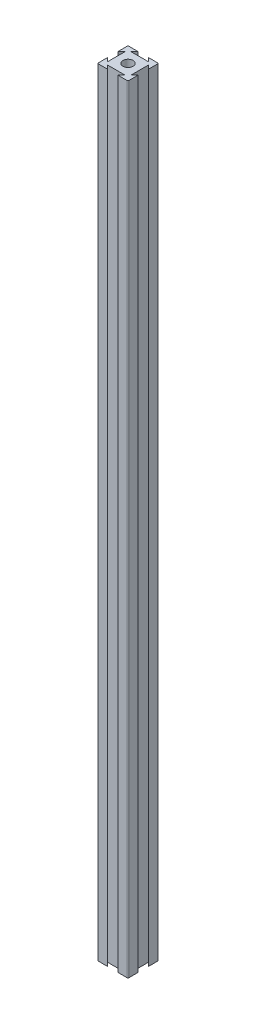
ISO-10303-21;
HEADER;
FILE_DESCRIPTION(('STEP AP214'),'2;1');
FILE_NAME('part.step','',(''),(''),'','','');
FILE_SCHEMA(('AUTOMOTIVE_DESIGN { 1 0 10303 214 1 1 1 1 }'));
ENDSEC;
DATA;
#1=APPLICATION_CONTEXT('core data for automotive mechanical design processes');
#2=APPLICATION_PROTOCOL_DEFINITION('international standard','automotive_design',2000,#1);
#3=PRODUCT_CONTEXT('',#1,'mechanical');
#4=PRODUCT('Part','Part','',(#3));
#5=PRODUCT_RELATED_PRODUCT_CATEGORY('part','',(#4));
#6=PRODUCT_DEFINITION_FORMATION('','',#4);
#7=PRODUCT_DEFINITION_CONTEXT('part definition',#1,'design');
#8=PRODUCT_DEFINITION('design','',#6,#7);
#9=PRODUCT_DEFINITION_SHAPE('','',#8);
#10=(LENGTH_UNIT() NAMED_UNIT(*) SI_UNIT(.MILLI.,.METRE.));
#11=(NAMED_UNIT(*) PLANE_ANGLE_UNIT() SI_UNIT($,.RADIAN.));
#12=(NAMED_UNIT(*) SI_UNIT($,.STERADIAN.) SOLID_ANGLE_UNIT());
#13=UNCERTAINTY_MEASURE_WITH_UNIT(LENGTH_MEASURE(1.E-05),#10,'distance_accuracy_value','');
#14=(GEOMETRIC_REPRESENTATION_CONTEXT(3) GLOBAL_UNCERTAINTY_ASSIGNED_CONTEXT((#13)) GLOBAL_UNIT_ASSIGNED_CONTEXT((#10,
#11,#12)) REPRESENTATION_CONTEXT('',''));
#15=CARTESIAN_POINT('',(0.,0.,0.));
#16=DIRECTION('',(0.,0.,1.));
#17=DIRECTION('',(1.,0.,0.));
#18=AXIS2_PLACEMENT_3D('',#15,#16,#17);
#19=CARTESIAN_POINT('',(16.6666666666667,508.762,-16.6666666666667));
#20=DIRECTION('',(-0.707106781186547,0.,0.707106781186548));
#21=DIRECTION('',(0.707106781186548,0.,0.707106781186547));
#22=AXIS2_PLACEMENT_3D('',#19,#20,#21);
#23=PLANE('',#22);
#24=DIRECTION('',(-0.707106781186548,0.,-0.707106781186547));
#25=VECTOR('',#24,1.);
#26=CARTESIAN_POINT('',(16.6666666666667,0.,-16.6666666666667));
#27=LINE('',#26,#25);
#28=CARTESIAN_POINT('',(20.,0.,-13.3333333333333));
#29=VERTEX_POINT('',#28);
#30=CARTESIAN_POINT('',(17.6183333333333,0.,-15.715));
#31=VERTEX_POINT('',#30);
#32=EDGE_CURVE('E203',#29,#31,#27,.T.);
#33=ORIENTED_EDGE('',*,*,#32,.F.);
#34=DIRECTION('',(0.,-1.,0.));
#35=VECTOR('',#34,1.);
#36=CARTESIAN_POINT('',(20.,508.762,-13.3333333333333));
#37=LINE('',#36,#35);
#38=CARTESIAN_POINT('',(20.,508.762,-13.3333333333333));
#39=VERTEX_POINT('',#38);
#40=EDGE_CURVE('E197',#39,#29,#37,.T.);
#41=ORIENTED_EDGE('',*,*,#40,.F.);
#42=DIRECTION('',(-0.707106781186548,0.,-0.707106781186547));
#43=VECTOR('',#42,1.);
#44=CARTESIAN_POINT('',(16.6666666666667,508.762,-16.6666666666667));
#45=LINE('',#44,#43);
#46=CARTESIAN_POINT('',(17.6183333333333,508.762,-15.715));
#47=VERTEX_POINT('',#46);
#48=EDGE_CURVE('E200',#39,#47,#45,.T.);
#49=ORIENTED_EDGE('',*,*,#48,.T.);
#50=DIRECTION('',(0.,-1.,0.));
#51=VECTOR('',#50,1.);
#52=CARTESIAN_POINT('',(17.6183333333333,508.762,-15.715));
#53=LINE('',#52,#51);
#54=EDGE_CURVE('E271',#47,#31,#53,.T.);
#55=ORIENTED_EDGE('',*,*,#54,.T.);
#56=EDGE_LOOP('',(#33,#41,#49,#55));
#57=FACE_BOUND('',#56,.T.);
#58=ADVANCED_FACE('F37',(#57),#23,.T.);
#59=CARTESIAN_POINT('',(20.,508.762,0.));
#60=DIRECTION('',(-1.,0.,0.));
#61=DIRECTION('',(0.,0.,1.));
#62=AXIS2_PLACEMENT_3D('',#59,#60,#61);
#63=PLANE('',#62);
#64=DIRECTION('',(0.,0.,-1.));
#65=VECTOR('',#64,1.);
#66=CARTESIAN_POINT('',(20.,0.,0.));
#67=LINE('',#66,#65);
#68=CARTESIAN_POINT('',(20.,0.,-19.492));
#69=VERTEX_POINT('',#68);
#70=EDGE_CURVE('E276',#29,#69,#67,.T.);
#71=ORIENTED_EDGE('',*,*,#70,.T.);
#72=DIRECTION('',(0.,-1.,0.));
#73=VECTOR('',#72,1.);
#74=CARTESIAN_POINT('',(20.,508.762,-19.492));
#75=LINE('',#74,#73);
#76=CARTESIAN_POINT('',(20.,508.762,-19.492));
#77=VERTEX_POINT('',#76);
#78=EDGE_CURVE('E214',#69,#77,#75,.F.);
#79=ORIENTED_EDGE('',*,*,#78,.T.);
#80=DIRECTION('',(0.,0.,-1.));
#81=VECTOR('',#80,1.);
#82=CARTESIAN_POINT('',(20.,508.762,0.));
#83=LINE('',#82,#81);
#84=EDGE_CURVE('E211',#39,#77,#83,.T.);
#85=ORIENTED_EDGE('',*,*,#84,.F.);
#86=ORIENTED_EDGE('',*,*,#40,.T.);
#87=EDGE_LOOP('',(#71,#79,#85,#86));
#88=FACE_BOUND('',#87,.T.);
#89=ADVANCED_FACE('F212',(#88),#63,.F.);
#90=CARTESIAN_POINT('',(0.,508.762,-20.));
#91=DIRECTION('',(0.,0.,-1.));
#92=DIRECTION('',(-1.,0.,0.));
#93=AXIS2_PLACEMENT_3D('',#90,#91,#92);
#94=PLANE('',#93);
#95=DIRECTION('',(1.,0.,0.));
#96=VECTOR('',#95,1.);
#97=CARTESIAN_POINT('',(0.,508.762,-20.));
#98=LINE('',#97,#96);
#99=CARTESIAN_POINT('',(13.3333333333333,508.762,-20.));
#100=VERTEX_POINT('',#99);
#101=CARTESIAN_POINT('',(19.492,508.762,-20.));
#102=VERTEX_POINT('',#101);
#103=EDGE_CURVE('E216',#100,#102,#98,.T.);
#104=ORIENTED_EDGE('',*,*,#103,.T.);
#105=DIRECTION('',(0.,-1.,0.));
#106=VECTOR('',#105,1.);
#107=CARTESIAN_POINT('',(19.492,0.,-20.));
#108=LINE('',#107,#106);
#109=CARTESIAN_POINT('',(19.492,0.,-20.));
#110=VERTEX_POINT('',#109);
#111=EDGE_CURVE('E378',#102,#110,#108,.T.);
#112=ORIENTED_EDGE('',*,*,#111,.T.);
#113=DIRECTION('',(1.,0.,0.));
#114=VECTOR('',#113,1.);
#115=CARTESIAN_POINT('',(0.,0.,-20.));
#116=LINE('',#115,#114);
#117=CARTESIAN_POINT('',(13.3333333333333,0.,-20.));
#118=VERTEX_POINT('',#117);
#119=EDGE_CURVE('E278',#118,#110,#116,.T.);
#120=ORIENTED_EDGE('',*,*,#119,.F.);
#121=DIRECTION('',(0.,-1.,0.));
#122=VECTOR('',#121,1.);
#123=CARTESIAN_POINT('',(13.3333333333333,508.762,-20.));
#124=LINE('',#123,#122);
#125=EDGE_CURVE('E208',#100,#118,#124,.T.);
#126=ORIENTED_EDGE('',*,*,#125,.F.);
#127=EDGE_LOOP('',(#104,#112,#120,#126));
#128=FACE_BOUND('',#127,.T.);
#129=ADVANCED_FACE('F410',(#128),#94,.T.);
#130=CARTESIAN_POINT('',(16.6666666666666,508.762,-16.6666666666668));
#131=DIRECTION('',(-0.707106781186544,0.,0.707106781186551));
#132=DIRECTION('',(0.707106781186551,0.,0.707106781186544));
#133=AXIS2_PLACEMENT_3D('',#130,#131,#132);
#134=PLANE('',#133);
#135=DIRECTION('',(-0.707106781186551,0.,-0.707106781186544));
#136=VECTOR('',#135,1.);
#137=CARTESIAN_POINT('',(16.6666666666666,0.,-16.6666666666668));
#138=LINE('',#137,#136);
#139=CARTESIAN_POINT('',(15.715,0.,-17.6183333333334));
#140=VERTEX_POINT('',#139);
#141=EDGE_CURVE('E282',#140,#118,#138,.T.);
#142=ORIENTED_EDGE('',*,*,#141,.F.);
#143=DIRECTION('',(0.,-1.,0.));
#144=VECTOR('',#143,1.);
#145=CARTESIAN_POINT('',(15.715,508.762,-17.6183333333334));
#146=LINE('',#145,#144);
#147=CARTESIAN_POINT('',(15.715,508.762,-17.6183333333334));
#148=VERTEX_POINT('',#147);
#149=EDGE_CURVE('E356',#148,#140,#146,.T.);
#150=ORIENTED_EDGE('',*,*,#149,.F.);
#151=DIRECTION('',(-0.707106781186551,0.,-0.707106781186544));
#152=VECTOR('',#151,1.);
#153=CARTESIAN_POINT('',(16.6666666666666,508.762,-16.6666666666668));
#154=LINE('',#153,#152);
#155=EDGE_CURVE('E232',#148,#100,#154,.T.);
#156=ORIENTED_EDGE('',*,*,#155,.T.);
#157=ORIENTED_EDGE('',*,*,#125,.T.);
#158=EDGE_LOOP('',(#142,#150,#156,#157));
#159=FACE_BOUND('',#158,.T.);
#160=ADVANCED_FACE('F414',(#159),#134,.T.);
#161=CARTESIAN_POINT('',(0.,508.762,-17.6183333333334));
#162=DIRECTION('',(0.,0.,-1.));
#163=DIRECTION('',(-1.,0.,0.));
#164=AXIS2_PLACEMENT_3D('',#161,#162,#163);
#165=PLANE('',#164);
#166=DIRECTION('',(1.,0.,0.));
#167=VECTOR('',#166,1.);
#168=CARTESIAN_POINT('',(0.,0.,-17.6183333333334));
#169=LINE('',#168,#167);
#170=CARTESIAN_POINT('',(4.285,0.,-17.6183333333334));
#171=VERTEX_POINT('',#170);
#172=EDGE_CURVE('E286',#171,#140,#169,.T.);
#173=ORIENTED_EDGE('',*,*,#172,.F.);
#174=DIRECTION('',(0.,-1.,0.));
#175=VECTOR('',#174,1.);
#176=CARTESIAN_POINT('',(4.285,508.762,-17.6183333333334));
#177=LINE('',#176,#175);
#178=CARTESIAN_POINT('',(4.285,508.762,-17.6183333333334));
#179=VERTEX_POINT('',#178);
#180=EDGE_CURVE('E354',#179,#171,#177,.T.);
#181=ORIENTED_EDGE('',*,*,#180,.F.);
#182=DIRECTION('',(1.,0.,0.));
#183=VECTOR('',#182,1.);
#184=CARTESIAN_POINT('',(0.,508.762,-17.6183333333334));
#185=LINE('',#184,#183);
#186=EDGE_CURVE('E236',#179,#148,#185,.T.);
#187=ORIENTED_EDGE('',*,*,#186,.T.);
#188=ORIENTED_EDGE('',*,*,#149,.T.);
#189=EDGE_LOOP('',(#173,#181,#187,#188));
#190=FACE_BOUND('',#189,.T.);
#191=ADVANCED_FACE('F441',(#190),#165,.T.);
#192=CARTESIAN_POINT('',(-6.6666666666667,508.762,-6.66666666666677));
#193=DIRECTION('',(0.707106781186544,0.,0.707106781186551));
#194=DIRECTION('',(0.707106781186551,0.,-0.707106781186544));
#195=AXIS2_PLACEMENT_3D('',#192,#193,#194);
#196=PLANE('',#195);
#197=DIRECTION('',(-0.707106781186551,0.,0.707106781186544));
#198=VECTOR('',#197,1.);
#199=CARTESIAN_POINT('',(-6.6666666666667,0.,-6.66666666666677));
#200=LINE('',#199,#198);
#201=CARTESIAN_POINT('',(6.66666666666666,0.,-20.));
#202=VERTEX_POINT('',#201);
#203=EDGE_CURVE('E289',#202,#171,#200,.T.);
#204=ORIENTED_EDGE('',*,*,#203,.F.);
#205=DIRECTION('',(0.,-1.,0.));
#206=VECTOR('',#205,1.);
#207=CARTESIAN_POINT('',(6.66666666666666,508.762,-20.));
#208=LINE('',#207,#206);
#209=CARTESIAN_POINT('',(6.66666666666666,508.762,-20.));
#210=VERTEX_POINT('',#209);
#211=EDGE_CURVE('E351',#210,#202,#208,.T.);
#212=ORIENTED_EDGE('',*,*,#211,.F.);
#213=DIRECTION('',(-0.707106781186551,0.,0.707106781186544));
#214=VECTOR('',#213,1.);
#215=CARTESIAN_POINT('',(-6.6666666666667,508.762,-6.66666666666677));
#216=LINE('',#215,#214);
#217=EDGE_CURVE('E239',#210,#179,#216,.T.);
#218=ORIENTED_EDGE('',*,*,#217,.T.);
#219=ORIENTED_EDGE('',*,*,#180,.T.);
#220=EDGE_LOOP('',(#204,#212,#218,#219));
#221=FACE_BOUND('',#220,.T.);
#222=ADVANCED_FACE('F444',(#221),#196,.T.);
#223=CARTESIAN_POINT('',(0.508,0.,-20.));
#224=VERTEX_POINT('',#223);
#225=EDGE_CURVE('E283',#224,#202,#116,.T.);
#226=ORIENTED_EDGE('',*,*,#225,.F.);
#227=DIRECTION('',(0.,-1.,0.));
#228=VECTOR('',#227,1.);
#229=CARTESIAN_POINT('',(0.508,508.762,-20.));
#230=LINE('',#229,#228);
#231=CARTESIAN_POINT('',(0.508,508.762,-20.));
#232=VERTEX_POINT('',#231);
#233=EDGE_CURVE('E369',#224,#232,#230,.F.);
#234=ORIENTED_EDGE('',*,*,#233,.T.);
#235=EDGE_CURVE('E233',#232,#210,#98,.T.);
#236=ORIENTED_EDGE('',*,*,#235,.T.);
#237=ORIENTED_EDGE('',*,*,#211,.T.);
#238=EDGE_LOOP('',(#226,#234,#236,#237));
#239=FACE_BOUND('',#238,.T.);
#240=ADVANCED_FACE('F507',(#239),#94,.T.);
#241=CARTESIAN_POINT('',(0.,508.762,0.));
#242=DIRECTION('',(-1.,0.,0.));
#243=DIRECTION('',(0.,0.,1.));
#244=AXIS2_PLACEMENT_3D('',#241,#242,#243);
#245=PLANE('',#244);
#246=DIRECTION('',(0.,0.,-1.));
#247=VECTOR('',#246,1.);
#248=CARTESIAN_POINT('',(0.,508.762,0.));
#249=LINE('',#248,#247);
#250=CARTESIAN_POINT('',(0.,508.762,-13.3333333333333));
#251=VERTEX_POINT('',#250);
#252=CARTESIAN_POINT('',(0.,508.762,-19.492));
#253=VERTEX_POINT('',#252);
#254=EDGE_CURVE('E242',#251,#253,#249,.T.);
#255=ORIENTED_EDGE('',*,*,#254,.T.);
#256=DIRECTION('',(0.,-1.,0.));
#257=VECTOR('',#256,1.);
#258=CARTESIAN_POINT('',(0.,508.762,-19.492));
#259=LINE('',#258,#257);
#260=CARTESIAN_POINT('',(0.,0.,-19.492));
#261=VERTEX_POINT('',#260);
#262=EDGE_CURVE('E207',#253,#261,#259,.T.);
#263=ORIENTED_EDGE('',*,*,#262,.T.);
#264=DIRECTION('',(0.,0.,-1.));
#265=VECTOR('',#264,1.);
#266=CARTESIAN_POINT('',(0.,0.,0.));
#267=LINE('',#266,#265);
#268=CARTESIAN_POINT('',(0.,0.,-13.3333333333333));
#269=VERTEX_POINT('',#268);
#270=EDGE_CURVE('E292',#269,#261,#267,.T.);
#271=ORIENTED_EDGE('',*,*,#270,.F.);
#272=DIRECTION('',(0.,-1.,0.));
#273=VECTOR('',#272,1.);
#274=CARTESIAN_POINT('',(0.,508.762,-13.3333333333333));
#275=LINE('',#274,#273);
#276=EDGE_CURVE('E349',#251,#269,#275,.T.);
#277=ORIENTED_EDGE('',*,*,#276,.F.);
#278=EDGE_LOOP('',(#255,#263,#271,#277));
#279=FACE_BOUND('',#278,.T.);
#280=ADVANCED_FACE('F453',(#279),#245,.T.);
#281=CARTESIAN_POINT('',(-6.66666666666667,508.762,-6.66666666666669));
#282=DIRECTION('',(-0.707106781186547,0.,-0.707106781186549));
#283=DIRECTION('',(-0.707106781186549,0.,0.707106781186547));
#284=AXIS2_PLACEMENT_3D('',#281,#282,#283);
#285=PLANE('',#284);
#286=DIRECTION('',(0.707106781186549,0.,-0.707106781186547));
#287=VECTOR('',#286,1.);
#288=CARTESIAN_POINT('',(-6.66666666666667,0.,-6.66666666666669));
#289=LINE('',#288,#287);
#290=CARTESIAN_POINT('',(2.38166666666667,0.,-15.715));
#291=VERTEX_POINT('',#290);
#292=EDGE_CURVE('E295',#269,#291,#289,.T.);
#293=ORIENTED_EDGE('',*,*,#292,.T.);
#294=DIRECTION('',(0.,-1.,0.));
#295=VECTOR('',#294,1.);
#296=CARTESIAN_POINT('',(2.38166666666667,508.762,-15.715));
#297=LINE('',#296,#295);
#298=CARTESIAN_POINT('',(2.38166666666667,508.762,-15.715));
#299=VERTEX_POINT('',#298);
#300=EDGE_CURVE('E346',#299,#291,#297,.T.);
#301=ORIENTED_EDGE('',*,*,#300,.F.);
#302=DIRECTION('',(0.707106781186549,0.,-0.707106781186547));
#303=VECTOR('',#302,1.);
#304=CARTESIAN_POINT('',(-6.66666666666667,508.762,-6.66666666666669));
#305=LINE('',#304,#303);
#306=EDGE_CURVE('E245',#251,#299,#305,.T.);
#307=ORIENTED_EDGE('',*,*,#306,.F.);
#308=ORIENTED_EDGE('',*,*,#276,.T.);
#309=EDGE_LOOP('',(#293,#301,#307,#308));
#310=FACE_BOUND('',#309,.T.);
#311=ADVANCED_FACE('F458',(#310),#285,.F.);
#312=CARTESIAN_POINT('',(2.38166666666667,508.762,0.));
#313=DIRECTION('',(1.,0.,0.));
#314=DIRECTION('',(0.,0.,-1.));
#315=AXIS2_PLACEMENT_3D('',#312,#313,#314);
#316=PLANE('',#315);
#317=DIRECTION('',(0.,0.,1.));
#318=VECTOR('',#317,1.);
#319=CARTESIAN_POINT('',(2.38166666666667,0.,0.));
#320=LINE('',#319,#318);
#321=CARTESIAN_POINT('',(2.38166666666667,0.,-4.285));
#322=VERTEX_POINT('',#321);
#323=EDGE_CURVE('E299',#291,#322,#320,.T.);
#324=ORIENTED_EDGE('',*,*,#323,.T.);
#325=DIRECTION('',(0.,-1.,0.));
#326=VECTOR('',#325,1.);
#327=CARTESIAN_POINT('',(2.38166666666667,508.762,-4.285));
#328=LINE('',#327,#326);
#329=CARTESIAN_POINT('',(2.38166666666667,508.762,-4.285));
#330=VERTEX_POINT('',#329);
#331=EDGE_CURVE('E343',#330,#322,#328,.T.);
#332=ORIENTED_EDGE('',*,*,#331,.F.);
#333=DIRECTION('',(0.,0.,1.));
#334=VECTOR('',#333,1.);
#335=CARTESIAN_POINT('',(2.38166666666667,508.762,0.));
#336=LINE('',#335,#334);
#337=EDGE_CURVE('E249',#299,#330,#336,.T.);
#338=ORIENTED_EDGE('',*,*,#337,.F.);
#339=ORIENTED_EDGE('',*,*,#300,.T.);
#340=EDGE_LOOP('',(#324,#332,#338,#339));
#341=FACE_BOUND('',#340,.T.);
#342=ADVANCED_FACE('F464',(#341),#316,.F.);
#343=CARTESIAN_POINT('',(3.33333333333333,508.762,-3.33333333333335));
#344=DIRECTION('',(-0.707106781186546,0.,0.707106781186549));
#345=DIRECTION('',(0.707106781186549,0.,0.707106781186546));
#346=AXIS2_PLACEMENT_3D('',#343,#344,#345);
#347=PLANE('',#346);
#348=DIRECTION('',(-0.707106781186549,0.,-0.707106781186546));
#349=VECTOR('',#348,1.);
#350=CARTESIAN_POINT('',(3.33333333333333,0.,-3.33333333333335));
#351=LINE('',#350,#349);
#352=CARTESIAN_POINT('',(0.,0.,-6.66666666666667));
#353=VERTEX_POINT('',#352);
#354=EDGE_CURVE('E302',#322,#353,#351,.T.);
#355=ORIENTED_EDGE('',*,*,#354,.T.);
#356=DIRECTION('',(0.,-1.,0.));
#357=VECTOR('',#356,1.);
#358=CARTESIAN_POINT('',(0.,508.762,-6.66666666666667));
#359=LINE('',#358,#357);
#360=CARTESIAN_POINT('',(0.,508.762,-6.66666666666667));
#361=VERTEX_POINT('',#360);
#362=EDGE_CURVE('E340',#361,#353,#359,.T.);
#363=ORIENTED_EDGE('',*,*,#362,.F.);
#364=DIRECTION('',(-0.707106781186549,0.,-0.707106781186546));
#365=VECTOR('',#364,1.);
#366=CARTESIAN_POINT('',(3.33333333333333,508.762,-3.33333333333335));
#367=LINE('',#366,#365);
#368=EDGE_CURVE('E252',#330,#361,#367,.T.);
#369=ORIENTED_EDGE('',*,*,#368,.F.);
#370=ORIENTED_EDGE('',*,*,#331,.T.);
#371=EDGE_LOOP('',(#355,#363,#369,#370));
#372=FACE_BOUND('',#371,.T.);
#373=ADVANCED_FACE('F466',(#372),#347,.F.);
#374=CARTESIAN_POINT('',(0.,0.,-0.508));
#375=VERTEX_POINT('',#374);
#376=EDGE_CURVE('E296',#375,#353,#267,.T.);
#377=ORIENTED_EDGE('',*,*,#376,.F.);
#378=DIRECTION('',(0.,-1.,0.));
#379=VECTOR('',#378,1.);
#380=CARTESIAN_POINT('',(0.,508.762,-0.508));
#381=LINE('',#380,#379);
#382=CARTESIAN_POINT('',(0.,508.762,-0.508));
#383=VERTEX_POINT('',#382);
#384=EDGE_CURVE('E385',#375,#383,#381,.F.);
#385=ORIENTED_EDGE('',*,*,#384,.T.);
#386=EDGE_CURVE('E246',#383,#361,#249,.T.);
#387=ORIENTED_EDGE('',*,*,#386,.T.);
#388=ORIENTED_EDGE('',*,*,#362,.T.);
#389=EDGE_LOOP('',(#377,#385,#387,#388));
#390=FACE_BOUND('',#389,.T.);
#391=ADVANCED_FACE('F469',(#390),#245,.T.);
#392=CARTESIAN_POINT('',(0.,508.762,0.));
#393=DIRECTION('',(0.,0.,-1.));
#394=DIRECTION('',(-1.,0.,0.));
#395=AXIS2_PLACEMENT_3D('',#392,#393,#394);
#396=PLANE('',#395);
#397=DIRECTION('',(1.,0.,0.));
#398=VECTOR('',#397,1.);
#399=CARTESIAN_POINT('',(0.,508.762,0.));
#400=LINE('',#399,#398);
#401=CARTESIAN_POINT('',(0.508,508.762,0.));
#402=VERTEX_POINT('',#401);
#403=CARTESIAN_POINT('',(6.66666666666667,508.762,0.));
#404=VERTEX_POINT('',#403);
#405=EDGE_CURVE('E255',#402,#404,#400,.T.);
#406=ORIENTED_EDGE('',*,*,#405,.F.);
#407=DIRECTION('',(0.,-1.,0.));
#408=VECTOR('',#407,1.);
#409=CARTESIAN_POINT('',(0.508,0.,0.));
#410=LINE('',#409,#408);
#411=CARTESIAN_POINT('',(0.508,0.,0.));
#412=VERTEX_POINT('',#411);
#413=EDGE_CURVE('E382',#402,#412,#410,.T.);
#414=ORIENTED_EDGE('',*,*,#413,.T.);
#415=DIRECTION('',(1.,0.,0.));
#416=VECTOR('',#415,1.);
#417=CARTESIAN_POINT('',(0.,0.,0.));
#418=LINE('',#417,#416);
#419=CARTESIAN_POINT('',(6.66666666666667,0.,0.));
#420=VERTEX_POINT('',#419);
#421=EDGE_CURVE('E305',#412,#420,#418,.T.);
#422=ORIENTED_EDGE('',*,*,#421,.T.);
#423=DIRECTION('',(0.,-1.,0.));
#424=VECTOR('',#423,1.);
#425=CARTESIAN_POINT('',(6.66666666666667,508.762,0.));
#426=LINE('',#425,#424);
#427=EDGE_CURVE('E337',#404,#420,#426,.T.);
#428=ORIENTED_EDGE('',*,*,#427,.F.);
#429=EDGE_LOOP('',(#406,#414,#422,#428));
#430=FACE_BOUND('',#429,.T.);
#431=ADVANCED_FACE('F476',(#430),#396,.F.);
#432=CARTESIAN_POINT('',(3.3333333333333,508.762,-3.33333333333333));
#433=DIRECTION('',(-0.707106781186544,0.,0.707106781186551));
#434=DIRECTION('',(0.707106781186551,0.,0.707106781186544));
#435=AXIS2_PLACEMENT_3D('',#432,#433,#434);
#436=PLANE('',#435);
#437=DIRECTION('',(-0.707106781186551,0.,-0.707106781186544));
#438=VECTOR('',#437,1.);
#439=CARTESIAN_POINT('',(3.3333333333333,0.,-3.33333333333333));
#440=LINE('',#439,#438);
#441=CARTESIAN_POINT('',(4.285,0.,-2.38166666666664));
#442=VERTEX_POINT('',#441);
#443=EDGE_CURVE('E307',#420,#442,#440,.T.);
#444=ORIENTED_EDGE('',*,*,#443,.T.);
#445=DIRECTION('',(0.,-1.,0.));
#446=VECTOR('',#445,1.);
#447=CARTESIAN_POINT('',(4.285,508.762,-2.38166666666664));
#448=LINE('',#447,#446);
#449=CARTESIAN_POINT('',(4.285,508.762,-2.38166666666664));
#450=VERTEX_POINT('',#449);
#451=EDGE_CURVE('E334',#450,#442,#448,.T.);
#452=ORIENTED_EDGE('',*,*,#451,.F.);
#453=DIRECTION('',(-0.707106781186551,0.,-0.707106781186544));
#454=VECTOR('',#453,1.);
#455=CARTESIAN_POINT('',(3.3333333333333,508.762,-3.33333333333333));
#456=LINE('',#455,#454);
#457=EDGE_CURVE('E257',#404,#450,#456,.T.);
#458=ORIENTED_EDGE('',*,*,#457,.F.);
#459=ORIENTED_EDGE('',*,*,#427,.T.);
#460=EDGE_LOOP('',(#444,#452,#458,#459));
#461=FACE_BOUND('',#460,.T.);
#462=ADVANCED_FACE('F482',(#461),#436,.F.);
#463=CARTESIAN_POINT('',(0.,508.762,-2.38166666666664));
#464=DIRECTION('',(0.,0.,-1.));
#465=DIRECTION('',(-1.,0.,0.));
#466=AXIS2_PLACEMENT_3D('',#463,#464,#465);
#467=PLANE('',#466);
#468=DIRECTION('',(1.,0.,0.));
#469=VECTOR('',#468,1.);
#470=CARTESIAN_POINT('',(0.,0.,-2.38166666666664));
#471=LINE('',#470,#469);
#472=CARTESIAN_POINT('',(15.715,0.,-2.38166666666664));
#473=VERTEX_POINT('',#472);
#474=EDGE_CURVE('E311',#442,#473,#471,.T.);
#475=ORIENTED_EDGE('',*,*,#474,.T.);
#476=DIRECTION('',(0.,-1.,0.));
#477=VECTOR('',#476,1.);
#478=CARTESIAN_POINT('',(15.715,508.762,-2.38166666666664));
#479=LINE('',#478,#477);
#480=CARTESIAN_POINT('',(15.715,508.762,-2.38166666666664));
#481=VERTEX_POINT('',#480);
#482=EDGE_CURVE('E331',#481,#473,#479,.T.);
#483=ORIENTED_EDGE('',*,*,#482,.F.);
#484=DIRECTION('',(1.,0.,0.));
#485=VECTOR('',#484,1.);
#486=CARTESIAN_POINT('',(0.,508.762,-2.38166666666664));
#487=LINE('',#486,#485);
#488=EDGE_CURVE('E261',#450,#481,#487,.T.);
#489=ORIENTED_EDGE('',*,*,#488,.F.);
#490=ORIENTED_EDGE('',*,*,#451,.T.);
#491=EDGE_LOOP('',(#475,#483,#489,#490));
#492=FACE_BOUND('',#491,.T.);
#493=ADVANCED_FACE('F485',(#492),#467,.F.);
#494=CARTESIAN_POINT('',(6.66666666666659,508.762,6.66666666666667));
#495=DIRECTION('',(0.707106781186544,0.,0.707106781186551));
#496=DIRECTION('',(0.707106781186551,0.,-0.707106781186544));
#497=AXIS2_PLACEMENT_3D('',#494,#495,#496);
#498=PLANE('',#497);
#499=DIRECTION('',(-0.707106781186551,0.,0.707106781186544));
#500=VECTOR('',#499,1.);
#501=CARTESIAN_POINT('',(6.66666666666659,0.,6.66666666666667));
#502=LINE('',#501,#500);
#503=CARTESIAN_POINT('',(13.3333333333333,0.,0.));
#504=VERTEX_POINT('',#503);
#505=EDGE_CURVE('E314',#473,#504,#502,.T.);
#506=ORIENTED_EDGE('',*,*,#505,.T.);
#507=DIRECTION('',(0.,-1.,0.));
#508=VECTOR('',#507,1.);
#509=CARTESIAN_POINT('',(13.3333333333333,508.762,0.));
#510=LINE('',#509,#508);
#511=CARTESIAN_POINT('',(13.3333333333333,508.762,0.));
#512=VERTEX_POINT('',#511);
#513=EDGE_CURVE('E328',#512,#504,#510,.T.);
#514=ORIENTED_EDGE('',*,*,#513,.F.);
#515=DIRECTION('',(-0.707106781186551,0.,0.707106781186544));
#516=VECTOR('',#515,1.);
#517=CARTESIAN_POINT('',(6.66666666666659,508.762,6.66666666666667));
#518=LINE('',#517,#516);
#519=EDGE_CURVE('E264',#481,#512,#518,.T.);
#520=ORIENTED_EDGE('',*,*,#519,.F.);
#521=ORIENTED_EDGE('',*,*,#482,.T.);
#522=EDGE_LOOP('',(#506,#514,#520,#521));
#523=FACE_BOUND('',#522,.T.);
#524=ADVANCED_FACE('F487',(#523),#498,.F.);
#525=CARTESIAN_POINT('',(19.492,0.,0.));
#526=VERTEX_POINT('',#525);
#527=EDGE_CURVE('E308',#504,#526,#418,.T.);
#528=ORIENTED_EDGE('',*,*,#527,.T.);
#529=DIRECTION('',(0.,-1.,0.));
#530=VECTOR('',#529,1.);
#531=CARTESIAN_POINT('',(19.492,508.762,0.));
#532=LINE('',#531,#530);
#533=CARTESIAN_POINT('',(19.492,508.762,0.));
#534=VERTEX_POINT('',#533);
#535=EDGE_CURVE('E11',#526,#534,#532,.F.);
#536=ORIENTED_EDGE('',*,*,#535,.T.);
#537=EDGE_CURVE('E258',#512,#534,#400,.T.);
#538=ORIENTED_EDGE('',*,*,#537,.F.);
#539=ORIENTED_EDGE('',*,*,#513,.T.);
#540=EDGE_LOOP('',(#528,#536,#538,#539));
#541=FACE_BOUND('',#540,.T.);
#542=ADVANCED_FACE('F396',(#541),#396,.F.);
#543=CARTESIAN_POINT('',(20.,508.762,-0.508));
#544=VERTEX_POINT('',#543);
#545=CARTESIAN_POINT('',(20.,508.762,-6.66666666666667));
#546=VERTEX_POINT('',#545);
#547=EDGE_CURVE('E218',#544,#546,#83,.T.);
#548=ORIENTED_EDGE('',*,*,#547,.F.);
#549=DIRECTION('',(0.,-1.,0.));
#550=VECTOR('',#549,1.);
#551=CARTESIAN_POINT('',(20.,508.762,-0.508));
#552=LINE('',#551,#550);
#553=CARTESIAN_POINT('',(20.,0.,-0.508));
#554=VERTEX_POINT('',#553);
#555=EDGE_CURVE('E45',#544,#554,#552,.T.);
#556=ORIENTED_EDGE('',*,*,#555,.T.);
#557=CARTESIAN_POINT('',(20.,0.,-6.66666666666667));
#558=VERTEX_POINT('',#557);
#559=EDGE_CURVE('E279',#554,#558,#67,.T.);
#560=ORIENTED_EDGE('',*,*,#559,.T.);
#561=DIRECTION('',(0.,-1.,0.));
#562=VECTOR('',#561,1.);
#563=CARTESIAN_POINT('',(20.,508.762,-6.66666666666667));
#564=LINE('',#563,#562);
#565=EDGE_CURVE('E325',#546,#558,#564,.T.);
#566=ORIENTED_EDGE('',*,*,#565,.F.);
#567=EDGE_LOOP('',(#548,#556,#560,#566));
#568=FACE_BOUND('',#567,.T.);
#569=ADVANCED_FACE('F390',(#568),#63,.F.);
#570=CARTESIAN_POINT('',(6.66666666666663,508.762,6.66666666666666));
#571=DIRECTION('',(-0.707106781186546,0.,-0.707106781186549));
#572=DIRECTION('',(-0.707106781186549,0.,0.707106781186546));
#573=AXIS2_PLACEMENT_3D('',#570,#571,#572);
#574=PLANE('',#573);
#575=DIRECTION('',(0.707106781186549,0.,-0.707106781186546));
#576=VECTOR('',#575,1.);
#577=CARTESIAN_POINT('',(6.66666666666663,0.,6.66666666666666));
#578=LINE('',#577,#576);
#579=CARTESIAN_POINT('',(17.6183333333333,0.,-4.285));
#580=VERTEX_POINT('',#579);
#581=EDGE_CURVE('E317',#580,#558,#578,.T.);
#582=ORIENTED_EDGE('',*,*,#581,.F.);
#583=DIRECTION('',(0.,-1.,0.));
#584=VECTOR('',#583,1.);
#585=CARTESIAN_POINT('',(17.6183333333333,508.762,-4.285));
#586=LINE('',#585,#584);
#587=CARTESIAN_POINT('',(17.6183333333333,508.762,-4.285));
#588=VERTEX_POINT('',#587);
#589=EDGE_CURVE('E323',#588,#580,#586,.T.);
#590=ORIENTED_EDGE('',*,*,#589,.F.);
#591=DIRECTION('',(0.707106781186549,0.,-0.707106781186546));
#592=VECTOR('',#591,1.);
#593=CARTESIAN_POINT('',(6.66666666666663,508.762,6.66666666666666));
#594=LINE('',#593,#592);
#595=EDGE_CURVE('E267',#588,#546,#594,.T.);
#596=ORIENTED_EDGE('',*,*,#595,.T.);
#597=ORIENTED_EDGE('',*,*,#565,.T.);
#598=EDGE_LOOP('',(#582,#590,#596,#597));
#599=FACE_BOUND('',#598,.T.);
#600=ADVANCED_FACE('F420',(#599),#574,.T.);
#601=CARTESIAN_POINT('',(10.,508.762,-10.));
#602=DIRECTION('',(0.,-1.,0.));
#603=DIRECTION('',(0.,0.,-1.));
#604=AXIS2_PLACEMENT_3D('',#601,#602,#603);
#605=CYLINDRICAL_SURFACE('',#604,3.33333333333333);
#606=CARTESIAN_POINT('',(10.,508.762,-10.));
#607=DIRECTION('',(0.,1.,0.));
#608=DIRECTION('',(0.,0.,1.));
#609=AXIS2_PLACEMENT_3D('',#606,#607,#608);
#610=CIRCLE('',#609,3.33333333333333);
#611=CARTESIAN_POINT('',(10.,508.762,-6.66666666666667));
#612=VERTEX_POINT('',#611);
#613=EDGE_CURVE('E224',#612,#612,#610,.T.);
#614=ORIENTED_EDGE('',*,*,#613,.T.);
#615=EDGE_LOOP('',(#614));
#616=FACE_BOUND('',#615,.T.);
#617=CARTESIAN_POINT('',(10.,0.,-10.));
#618=DIRECTION('',(0.,1.,0.));
#619=DIRECTION('',(0.,0.,1.));
#620=AXIS2_PLACEMENT_3D('',#617,#618,#619);
#621=CIRCLE('',#620,3.33333333333333);
#622=CARTESIAN_POINT('',(10.,0.,-6.66666666666667));
#623=VERTEX_POINT('',#622);
#624=EDGE_CURVE('E272',#623,#623,#621,.T.);
#625=ORIENTED_EDGE('',*,*,#624,.F.);
#626=EDGE_LOOP('',(#625));
#627=FACE_BOUND('',#626,.T.);
#628=ADVANCED_FACE('F416',(#616,#627),#605,.F.);
#629=CARTESIAN_POINT('',(17.6183333333333,508.762,0.));
#630=DIRECTION('',(1.,0.,0.));
#631=DIRECTION('',(0.,0.,-1.));
#632=AXIS2_PLACEMENT_3D('',#629,#630,#631);
#633=PLANE('',#632);
#634=DIRECTION('',(0.,0.,1.));
#635=VECTOR('',#634,1.);
#636=CARTESIAN_POINT('',(17.6183333333333,0.,0.));
#637=LINE('',#636,#635);
#638=EDGE_CURVE('E227',#31,#580,#637,.T.);
#639=ORIENTED_EDGE('',*,*,#638,.F.);
#640=ORIENTED_EDGE('',*,*,#54,.F.);
#641=DIRECTION('',(0.,0.,1.));
#642=VECTOR('',#641,1.);
#643=CARTESIAN_POINT('',(17.6183333333333,508.762,0.));
#644=LINE('',#643,#642);
#645=EDGE_CURVE('E223',#47,#588,#644,.T.);
#646=ORIENTED_EDGE('',*,*,#645,.T.);
#647=ORIENTED_EDGE('',*,*,#589,.T.);
#648=EDGE_LOOP('',(#639,#640,#646,#647));
#649=FACE_BOUND('',#648,.T.);
#650=ADVANCED_FACE('F419',(#649),#633,.T.);
#651=CARTESIAN_POINT('',(0.,508.762,0.));
#652=DIRECTION('',(0.,1.,0.));
#653=DIRECTION('',(0.,0.,1.));
#654=AXIS2_PLACEMENT_3D('',#651,#652,#653);
#655=PLANE('',#654);
#656=ORIENTED_EDGE('',*,*,#613,.F.);
#657=EDGE_LOOP('',(#656));
#658=FACE_BOUND('',#657,.T.);
#659=ORIENTED_EDGE('',*,*,#235,.F.);
#660=CARTESIAN_POINT('',(0.508,508.762,-19.492));
#661=DIRECTION('',(0.,1.,0.));
#662=DIRECTION('',(0.,0.,1.));
#663=AXIS2_PLACEMENT_3D('',#660,#661,#662);
#664=CIRCLE('',#663,0.508);
#665=EDGE_CURVE('E376',#232,#253,#664,.T.);
#666=ORIENTED_EDGE('',*,*,#665,.T.);
#667=ORIENTED_EDGE('',*,*,#254,.F.);
#668=ORIENTED_EDGE('',*,*,#306,.T.);
#669=ORIENTED_EDGE('',*,*,#337,.T.);
#670=ORIENTED_EDGE('',*,*,#368,.T.);
#671=ORIENTED_EDGE('',*,*,#386,.F.);
#672=CARTESIAN_POINT('',(0.508,508.762,-0.508));
#673=DIRECTION('',(0.,1.,0.));
#674=DIRECTION('',(0.,0.,1.));
#675=AXIS2_PLACEMENT_3D('',#672,#673,#674);
#676=CIRCLE('',#675,0.508);
#677=EDGE_CURVE('E372',#383,#402,#676,.T.);
#678=ORIENTED_EDGE('',*,*,#677,.T.);
#679=ORIENTED_EDGE('',*,*,#405,.T.);
#680=ORIENTED_EDGE('',*,*,#457,.T.);
#681=ORIENTED_EDGE('',*,*,#488,.T.);
#682=ORIENTED_EDGE('',*,*,#519,.T.);
#683=ORIENTED_EDGE('',*,*,#537,.T.);
#684=CARTESIAN_POINT('',(19.492,508.762,-0.508));
#685=DIRECTION('',(0.,1.,0.));
#686=DIRECTION('',(0.,0.,1.));
#687=AXIS2_PLACEMENT_3D('',#684,#685,#686);
#688=CIRCLE('',#687,0.508);
#689=EDGE_CURVE('E52',#534,#544,#688,.T.);
#690=ORIENTED_EDGE('',*,*,#689,.T.);
#691=ORIENTED_EDGE('',*,*,#547,.T.);
#692=ORIENTED_EDGE('',*,*,#595,.F.);
#693=ORIENTED_EDGE('',*,*,#645,.F.);
#694=ORIENTED_EDGE('',*,*,#48,.F.);
#695=ORIENTED_EDGE('',*,*,#84,.T.);
#696=CARTESIAN_POINT('',(19.492,508.762,-19.492));
#697=DIRECTION('',(0.,1.,0.));
#698=DIRECTION('',(0.,0.,1.));
#699=AXIS2_PLACEMENT_3D('',#696,#697,#698);
#700=CIRCLE('',#699,0.508);
#701=EDGE_CURVE('E374',#77,#102,#700,.T.);
#702=ORIENTED_EDGE('',*,*,#701,.T.);
#703=ORIENTED_EDGE('',*,*,#103,.F.);
#704=ORIENTED_EDGE('',*,*,#155,.F.);
#705=ORIENTED_EDGE('',*,*,#186,.F.);
#706=ORIENTED_EDGE('',*,*,#217,.F.);
#707=EDGE_LOOP('',(#659,#666,#667,#668,#669,#670,#671,#678,#679,#680,#681,#682,#683,#690,#691,
#692,#693,#694,#695,#702,#703,#704,#705,#706));
#708=FACE_BOUND('',#707,.T.);
#709=ADVANCED_FACE('F220',(#658,#708),#655,.T.);
#710=CARTESIAN_POINT('',(0.,0.,0.));
#711=DIRECTION('',(0.,1.,0.));
#712=DIRECTION('',(0.,0.,1.));
#713=AXIS2_PLACEMENT_3D('',#710,#711,#712);
#714=PLANE('',#713);
#715=ORIENTED_EDGE('',*,*,#624,.T.);
#716=EDGE_LOOP('',(#715));
#717=FACE_BOUND('',#716,.T.);
#718=ORIENTED_EDGE('',*,*,#270,.T.);
#719=CARTESIAN_POINT('',(0.508,0.,-19.492));
#720=DIRECTION('',(0.,1.,0.));
#721=DIRECTION('',(0.,0.,1.));
#722=AXIS2_PLACEMENT_3D('',#719,#720,#721);
#723=CIRCLE('',#722,0.508);
#724=EDGE_CURVE('E367',#261,#224,#723,.F.);
#725=ORIENTED_EDGE('',*,*,#724,.T.);
#726=ORIENTED_EDGE('',*,*,#225,.T.);
#727=ORIENTED_EDGE('',*,*,#203,.T.);
#728=ORIENTED_EDGE('',*,*,#172,.T.);
#729=ORIENTED_EDGE('',*,*,#141,.T.);
#730=ORIENTED_EDGE('',*,*,#119,.T.);
#731=CARTESIAN_POINT('',(19.492,0.,-19.492));
#732=DIRECTION('',(0.,1.,0.));
#733=DIRECTION('',(0.,0.,1.));
#734=AXIS2_PLACEMENT_3D('',#731,#732,#733);
#735=CIRCLE('',#734,0.508);
#736=EDGE_CURVE('E365',#110,#69,#735,.F.);
#737=ORIENTED_EDGE('',*,*,#736,.T.);
#738=ORIENTED_EDGE('',*,*,#70,.F.);
#739=ORIENTED_EDGE('',*,*,#32,.T.);
#740=ORIENTED_EDGE('',*,*,#638,.T.);
#741=ORIENTED_EDGE('',*,*,#581,.T.);
#742=ORIENTED_EDGE('',*,*,#559,.F.);
#743=CARTESIAN_POINT('',(19.492,0.,-0.508));
#744=DIRECTION('',(0.,1.,0.));
#745=DIRECTION('',(0.,0.,1.));
#746=AXIS2_PLACEMENT_3D('',#743,#744,#745);
#747=CIRCLE('',#746,0.508);
#748=EDGE_CURVE('E361',#554,#526,#747,.F.);
#749=ORIENTED_EDGE('',*,*,#748,.T.);
#750=ORIENTED_EDGE('',*,*,#527,.F.);
#751=ORIENTED_EDGE('',*,*,#505,.F.);
#752=ORIENTED_EDGE('',*,*,#474,.F.);
#753=ORIENTED_EDGE('',*,*,#443,.F.);
#754=ORIENTED_EDGE('',*,*,#421,.F.);
#755=CARTESIAN_POINT('',(0.508,0.,-0.508));
#756=DIRECTION('',(0.,1.,0.));
#757=DIRECTION('',(0.,0.,1.));
#758=AXIS2_PLACEMENT_3D('',#755,#756,#757);
#759=CIRCLE('',#758,0.508);
#760=EDGE_CURVE('E363',#412,#375,#759,.F.);
#761=ORIENTED_EDGE('',*,*,#760,.T.);
#762=ORIENTED_EDGE('',*,*,#376,.T.);
#763=ORIENTED_EDGE('',*,*,#354,.F.);
#764=ORIENTED_EDGE('',*,*,#323,.F.);
#765=ORIENTED_EDGE('',*,*,#292,.F.);
#766=EDGE_LOOP('',(#718,#725,#726,#727,#728,#729,#730,#737,#738,#739,#740,#741,#742,#749,#750,
#751,#752,#753,#754,#761,#762,#763,#764,#765));
#767=FACE_BOUND('',#766,.T.);
#768=ADVANCED_FACE('F394',(#717,#767),#714,.F.);
#769=CARTESIAN_POINT('',(0.508,508.762,-19.492));
#770=DIRECTION('',(0.,-1.,0.));
#771=DIRECTION('',(0.,0.,-1.));
#772=AXIS2_PLACEMENT_3D('',#769,#770,#771);
#773=CYLINDRICAL_SURFACE('',#772,0.508);
#774=ORIENTED_EDGE('',*,*,#665,.F.);
#775=ORIENTED_EDGE('',*,*,#233,.F.);
#776=ORIENTED_EDGE('',*,*,#724,.F.);
#777=ORIENTED_EDGE('',*,*,#262,.F.);
#778=EDGE_LOOP('',(#774,#775,#776,#777));
#779=FACE_BOUND('',#778,.T.);
#780=ADVANCED_FACE('F422',(#779),#773,.T.);
#781=CARTESIAN_POINT('',(19.492,508.762,-19.492));
#782=DIRECTION('',(0.,1.,0.));
#783=DIRECTION('',(0.,0.,1.));
#784=AXIS2_PLACEMENT_3D('',#781,#782,#783);
#785=CYLINDRICAL_SURFACE('',#784,0.508);
#786=ORIENTED_EDGE('',*,*,#701,.F.);
#787=ORIENTED_EDGE('',*,*,#78,.F.);
#788=ORIENTED_EDGE('',*,*,#736,.F.);
#789=ORIENTED_EDGE('',*,*,#111,.F.);
#790=EDGE_LOOP('',(#786,#787,#788,#789));
#791=FACE_BOUND('',#790,.T.);
#792=ADVANCED_FACE('F403',(#791),#785,.T.);
#793=CARTESIAN_POINT('',(0.508,508.762,-0.508));
#794=DIRECTION('',(0.,1.,0.));
#795=DIRECTION('',(0.,0.,1.));
#796=AXIS2_PLACEMENT_3D('',#793,#794,#795);
#797=CYLINDRICAL_SURFACE('',#796,0.508);
#798=ORIENTED_EDGE('',*,*,#677,.F.);
#799=ORIENTED_EDGE('',*,*,#384,.F.);
#800=ORIENTED_EDGE('',*,*,#760,.F.);
#801=ORIENTED_EDGE('',*,*,#413,.F.);
#802=EDGE_LOOP('',(#798,#799,#800,#801));
#803=FACE_BOUND('',#802,.T.);
#804=ADVANCED_FACE('F399',(#803),#797,.T.);
#805=CARTESIAN_POINT('',(19.492,508.762,-0.508));
#806=DIRECTION('',(0.,-1.,0.));
#807=DIRECTION('',(0.,0.,-1.));
#808=AXIS2_PLACEMENT_3D('',#805,#806,#807);
#809=CYLINDRICAL_SURFACE('',#808,0.508);
#810=ORIENTED_EDGE('',*,*,#689,.F.);
#811=ORIENTED_EDGE('',*,*,#535,.F.);
#812=ORIENTED_EDGE('',*,*,#748,.F.);
#813=ORIENTED_EDGE('',*,*,#555,.F.);
#814=EDGE_LOOP('',(#810,#811,#812,#813));
#815=FACE_BOUND('',#814,.T.);
#816=ADVANCED_FACE('F39',(#815),#809,.T.);
#817=CLOSED_SHELL('',(#58,#89,#129,#160,#191,#222,#240,#280,#311,#342,#373,#391,#431,#462,#493,
#524,#542,#569,#600,#628,#650,#709,#768,#780,#792,#804,#816));
#818=MANIFOLD_SOLID_BREP('B2',#817);
#819=ADVANCED_BREP_SHAPE_REPRESENTATION('',(#18,#818),#14);
#820=SHAPE_DEFINITION_REPRESENTATION(#9,#819);
ENDSEC;
END-ISO-10303-21;
